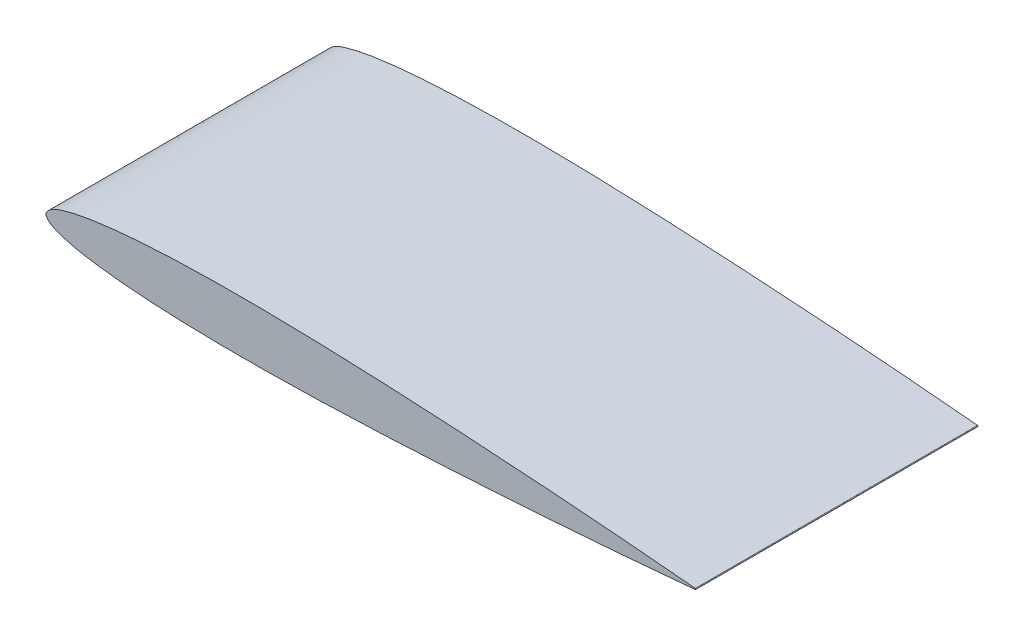
ISO-10303-21;
HEADER;
FILE_DESCRIPTION(('STEP AP214'),'2;1');
FILE_NAME('part.step','',(''),(''),'','','');
FILE_SCHEMA(('AUTOMOTIVE_DESIGN { 1 0 10303 214 1 1 1 1 }'));
ENDSEC;
DATA;
#1=APPLICATION_CONTEXT('core data for automotive mechanical design processes');
#2=APPLICATION_PROTOCOL_DEFINITION('international standard','automotive_design',2000,#1);
#3=PRODUCT_CONTEXT('',#1,'mechanical');
#4=PRODUCT('Part','Part','',(#3));
#5=PRODUCT_RELATED_PRODUCT_CATEGORY('part','',(#4));
#6=PRODUCT_DEFINITION_FORMATION('','',#4);
#7=PRODUCT_DEFINITION_CONTEXT('part definition',#1,'design');
#8=PRODUCT_DEFINITION('design','',#6,#7);
#9=PRODUCT_DEFINITION_SHAPE('','',#8);
#10=(LENGTH_UNIT() NAMED_UNIT(*) SI_UNIT(.MILLI.,.METRE.));
#11=(NAMED_UNIT(*) PLANE_ANGLE_UNIT() SI_UNIT($,.RADIAN.));
#12=(NAMED_UNIT(*) SI_UNIT($,.STERADIAN.) SOLID_ANGLE_UNIT());
#13=UNCERTAINTY_MEASURE_WITH_UNIT(LENGTH_MEASURE(1.E-05),#10,'distance_accuracy_value','');
#14=(GEOMETRIC_REPRESENTATION_CONTEXT(3) GLOBAL_UNCERTAINTY_ASSIGNED_CONTEXT((#13)) GLOBAL_UNIT_ASSIGNED_CONTEXT((#10,
#11,#12)) REPRESENTATION_CONTEXT('',''));
#15=CARTESIAN_POINT('',(0.,0.,0.));
#16=DIRECTION('',(0.,0.,1.));
#17=DIRECTION('',(1.,0.,0.));
#18=AXIS2_PLACEMENT_3D('',#15,#16,#17);
#19=CARTESIAN_POINT('',(115.,0.0966,50.));
#20=CARTESIAN_POINT('',(113.083512137173,0.272258452063669,50.));
#21=CARTESIAN_POINT('',(109.251373934239,0.623498591841248,50.));
#22=CARTESIAN_POINT('',(101.585893564366,1.27753382718011,50.));
#23=CARTESIAN_POINT('',(92.0037873596529,2.02815264449112,50.));
#24=CARTESIAN_POINT('',(80.5034487734738,2.82654094642564,50.));
#25=CARTESIAN_POINT('',(69.0035703192166,3.52100988200203,50.));
#26=CARTESIAN_POINT('',(57.5034598906153,4.08496009345538,50.));
#27=CARTESIAN_POINT('',(46.0029883413461,4.48838846778457,50.));
#28=CARTESIAN_POINT('',(36.4170057087206,4.62904917325832,50.));
#29=CARTESIAN_POINT('',(28.7490277903759,4.57347385950604,50.));
#30=CARTESIAN_POINT('',(22.997441924801,4.4217228580537,50.));
#31=CARTESIAN_POINT('',(17.2423676011774,4.13136000241049,50.));
#32=CARTESIAN_POINT('',(12.451261674613,3.72329931575348,50.));
#33=CARTESIAN_POINT('',(8.6124125462031,3.23612457176858,50.));
#34=CARTESIAN_POINT('',(5.74263384764909,2.76422401818186,50.));
#35=CARTESIAN_POINT('',(3.27707029080865,2.14811431843386,50.));
#36=CARTESIAN_POINT('',(1.34022552815491,1.51913533960532,50.));
#37=CARTESIAN_POINT('',(-0.764305851746083,0.,50.));
#38=CARTESIAN_POINT('',(1.3402255281549,-1.51913533960531,50.));
#39=CARTESIAN_POINT('',(3.27707029080866,-2.14811431843387,50.));
#40=CARTESIAN_POINT('',(5.74263384764909,-2.76422401818186,50.));
#41=CARTESIAN_POINT('',(8.61241254620308,-3.23612457176858,50.));
#42=CARTESIAN_POINT('',(12.451261674613,-3.72329931575348,50.));
#43=CARTESIAN_POINT('',(17.2423676011774,-4.13136000241049,50.));
#44=CARTESIAN_POINT('',(22.997441924801,-4.4217228580537,50.));
#45=CARTESIAN_POINT('',(28.7490277903759,-4.57347385950604,50.));
#46=CARTESIAN_POINT('',(36.4170057087206,-4.62904917325832,50.));
#47=CARTESIAN_POINT('',(46.0029883413461,-4.48838846778457,50.));
#48=CARTESIAN_POINT('',(57.5034598906153,-4.08496009345538,50.));
#49=CARTESIAN_POINT('',(69.0035703192166,-3.52100988200203,50.));
#50=CARTESIAN_POINT('',(80.5034487734738,-2.82654094642564,50.));
#51=CARTESIAN_POINT('',(92.0037873596529,-2.02815264449112,50.));
#52=CARTESIAN_POINT('',(101.585893564366,-1.27753382718011,50.));
#53=CARTESIAN_POINT('',(109.251373934239,-0.623498591841247,50.));
#54=CARTESIAN_POINT('',(113.083512137173,-0.272258452063669,50.));
#55=CARTESIAN_POINT('',(115.,-0.0966,50.));
#56=B_SPLINE_CURVE_WITH_KNOTS('',3,(#19,#20,#21,#22,#23,#24,#25,#26,#27,#28,#29,#30,#31,#32,#33,
#34,#35,#36,#37,#38,#39,#40,#41,#42,#43,#44,#45,#46,#47,#48,#49,#50,#51,#52,#53,#54,#55),
.UNSPECIFIED.,.F.,.F.,(4,1,1,1,1,1,1,1,1,1,1,1,1,1,1,1,1,1,1,1,1,1,1,1,1,1,1,1,1,1,1,1,1,1,4),
(0.,0.0248762929189861,0.0497417146704998,0.0994434021110951,0.149112224036195,
0.198750974066913,0.248359097492202,0.297937369716024,0.347491327096237,0.37226694027957,
0.39705092368842,0.421859474838904,0.446731345826762,0.459220451479859,0.471790601601357,
0.484560454432956,0.491195112481227,0.5,0.508804887518773,0.515439545567044,0.528209398398643,
0.540779548520142,0.553268654173238,0.578140525161096,0.60294907631158,0.62773305972043,
0.652508672903763,0.702062630283976,0.751640902507798,0.801249025933087,0.850887775963805,
0.900556597888905,0.9502582853295,0.975123707081014,1.),.UNSPECIFIED.);
#57=DIRECTION('',(0.,0.,-1.));
#58=VECTOR('',#57,1.);
#59=SURFACE_OF_LINEAR_EXTRUSION('',#56,#58);
#60=CARTESIAN_POINT('',(115.,0.0966,0.));
#61=CARTESIAN_POINT('',(113.083512137173,0.272258452063669,0.));
#62=CARTESIAN_POINT('',(109.251373934239,0.623498591841248,0.));
#63=CARTESIAN_POINT('',(101.585893564366,1.27753382718011,0.));
#64=CARTESIAN_POINT('',(92.0037873596529,2.02815264449112,0.));
#65=CARTESIAN_POINT('',(80.5034487734738,2.82654094642564,0.));
#66=CARTESIAN_POINT('',(69.0035703192166,3.52100988200203,0.));
#67=CARTESIAN_POINT('',(57.5034598906153,4.08496009345538,0.));
#68=CARTESIAN_POINT('',(46.0029883413461,4.48838846778457,0.));
#69=CARTESIAN_POINT('',(36.4170057087206,4.62904917325832,0.));
#70=CARTESIAN_POINT('',(28.7490277903759,4.57347385950604,0.));
#71=CARTESIAN_POINT('',(22.997441924801,4.4217228580537,0.));
#72=CARTESIAN_POINT('',(17.2423676011774,4.13136000241049,0.));
#73=CARTESIAN_POINT('',(12.451261674613,3.72329931575348,0.));
#74=CARTESIAN_POINT('',(8.6124125462031,3.23612457176858,0.));
#75=CARTESIAN_POINT('',(5.74263384764909,2.76422401818186,0.));
#76=CARTESIAN_POINT('',(3.27707029080865,2.14811431843386,0.));
#77=CARTESIAN_POINT('',(1.34022552815491,1.51913533960532,0.));
#78=CARTESIAN_POINT('',(-0.764305851746083,0.,0.));
#79=CARTESIAN_POINT('',(1.3402255281549,-1.51913533960531,0.));
#80=CARTESIAN_POINT('',(3.27707029080866,-2.14811431843387,0.));
#81=CARTESIAN_POINT('',(5.74263384764909,-2.76422401818186,0.));
#82=CARTESIAN_POINT('',(8.61241254620308,-3.23612457176858,0.));
#83=CARTESIAN_POINT('',(12.451261674613,-3.72329931575348,0.));
#84=CARTESIAN_POINT('',(17.2423676011774,-4.13136000241049,0.));
#85=CARTESIAN_POINT('',(22.997441924801,-4.4217228580537,0.));
#86=CARTESIAN_POINT('',(28.7490277903759,-4.57347385950604,0.));
#87=CARTESIAN_POINT('',(36.4170057087206,-4.62904917325832,0.));
#88=CARTESIAN_POINT('',(46.0029883413461,-4.48838846778457,0.));
#89=CARTESIAN_POINT('',(57.5034598906153,-4.08496009345538,0.));
#90=CARTESIAN_POINT('',(69.0035703192166,-3.52100988200203,0.));
#91=CARTESIAN_POINT('',(80.5034487734738,-2.82654094642564,0.));
#92=CARTESIAN_POINT('',(92.0037873596529,-2.02815264449112,0.));
#93=CARTESIAN_POINT('',(101.585893564366,-1.27753382718011,0.));
#94=CARTESIAN_POINT('',(109.251373934239,-0.623498591841247,0.));
#95=CARTESIAN_POINT('',(113.083512137173,-0.272258452063669,0.));
#96=CARTESIAN_POINT('',(115.,-0.0966,0.));
#97=B_SPLINE_CURVE_WITH_KNOTS('',3,(#60,#61,#62,#63,#64,#65,#66,#67,#68,#69,#70,#71,#72,#73,#74,
#75,#76,#77,#78,#79,#80,#81,#82,#83,#84,#85,#86,#87,#88,#89,#90,#91,#92,#93,#94,#95,#96),
.UNSPECIFIED.,.F.,.F.,(4,1,1,1,1,1,1,1,1,1,1,1,1,1,1,1,1,1,1,1,1,1,1,1,1,1,1,1,1,1,1,1,1,1,4),
(0.,0.0248762929189861,0.0497417146704998,0.0994434021110951,0.149112224036195,
0.198750974066913,0.248359097492202,0.297937369716024,0.347491327096237,0.37226694027957,
0.39705092368842,0.421859474838904,0.446731345826762,0.459220451479859,0.471790601601357,
0.484560454432956,0.491195112481227,0.5,0.508804887518773,0.515439545567044,0.528209398398643,
0.540779548520142,0.553268654173238,0.578140525161096,0.60294907631158,0.62773305972043,
0.652508672903763,0.702062630283976,0.751640902507798,0.801249025933087,0.850887775963805,
0.900556597888905,0.9502582853295,0.975123707081014,1.),.UNSPECIFIED.);
#98=CARTESIAN_POINT('',(115.,0.0966,0.));
#99=VERTEX_POINT('',#98);
#100=CARTESIAN_POINT('',(115.,-0.0966000000000001,0.));
#101=VERTEX_POINT('',#100);
#102=EDGE_CURVE('E65',#99,#101,#97,.T.);
#103=ORIENTED_EDGE('',*,*,#102,.T.);
#104=DIRECTION('',(0.,0.,-1.));
#105=VECTOR('',#104,1.);
#106=CARTESIAN_POINT('',(115.,-0.0966000000000001,50.));
#107=LINE('',#106,#105);
#108=CARTESIAN_POINT('',(115.,-0.0966000000000001,50.));
#109=VERTEX_POINT('',#108);
#110=EDGE_CURVE('E11',#109,#101,#107,.T.);
#111=ORIENTED_EDGE('',*,*,#110,.F.);
#112=CARTESIAN_POINT('',(115.,0.0966,50.));
#113=VERTEX_POINT('',#112);
#114=EDGE_CURVE('E64',#113,#109,#56,.T.);
#115=ORIENTED_EDGE('',*,*,#114,.F.);
#116=DIRECTION('',(0.,0.,-1.));
#117=VECTOR('',#116,1.);
#118=CARTESIAN_POINT('',(115.,0.0966,50.));
#119=LINE('',#118,#117);
#120=EDGE_CURVE('E42',#113,#99,#119,.T.);
#121=ORIENTED_EDGE('',*,*,#120,.T.);
#122=EDGE_LOOP('',(#103,#111,#115,#121));
#123=FACE_BOUND('',#122,.T.);
#124=ADVANCED_FACE('F33',(#123),#59,.F.);
#125=CARTESIAN_POINT('',(114.991145988034,0.,50.));
#126=DIRECTION('',(0.,0.,-1.));
#127=DIRECTION('',(-1.,0.,0.));
#128=AXIS2_PLACEMENT_3D('',#125,#126,#127);
#129=CYLINDRICAL_SURFACE('',#128,0.0970049149676787);
#130=CARTESIAN_POINT('',(114.991145988034,0.,0.));
#131=DIRECTION('',(0.,0.,1.));
#132=DIRECTION('',(-1.,0.,0.));
#133=AXIS2_PLACEMENT_3D('',#130,#131,#132);
#134=CIRCLE('',#133,0.0970049149676787);
#135=EDGE_CURVE('E57',#101,#99,#134,.T.);
#136=ORIENTED_EDGE('',*,*,#135,.T.);
#137=ORIENTED_EDGE('',*,*,#120,.F.);
#138=CARTESIAN_POINT('',(114.991145988034,0.,50.));
#139=DIRECTION('',(0.,0.,1.));
#140=DIRECTION('',(-1.,0.,0.));
#141=AXIS2_PLACEMENT_3D('',#138,#139,#140);
#142=CIRCLE('',#141,0.0970049149676787);
#143=EDGE_CURVE('E49',#109,#113,#142,.T.);
#144=ORIENTED_EDGE('',*,*,#143,.F.);
#145=ORIENTED_EDGE('',*,*,#110,.T.);
#146=EDGE_LOOP('',(#136,#137,#144,#145));
#147=FACE_BOUND('',#146,.T.);
#148=ADVANCED_FACE('F60',(#147),#129,.T.);
#149=CARTESIAN_POINT('',(0.,0.,50.));
#150=DIRECTION('',(0.,0.,-1.));
#151=DIRECTION('',(-1.,0.,0.));
#152=AXIS2_PLACEMENT_3D('',#149,#150,#151);
#153=PLANE('',#152);
#154=ORIENTED_EDGE('',*,*,#114,.T.);
#155=ORIENTED_EDGE('',*,*,#143,.T.);
#156=EDGE_LOOP('',(#154,#155));
#157=FACE_BOUND('',#156,.T.);
#158=ADVANCED_FACE('F82',(#157),#153,.F.);
#159=CARTESIAN_POINT('',(0.,0.,0.));
#160=DIRECTION('',(0.,0.,-1.));
#161=DIRECTION('',(-1.,0.,0.));
#162=AXIS2_PLACEMENT_3D('',#159,#160,#161);
#163=PLANE('',#162);
#164=ORIENTED_EDGE('',*,*,#102,.F.);
#165=ORIENTED_EDGE('',*,*,#135,.F.);
#166=EDGE_LOOP('',(#164,#165));
#167=FACE_BOUND('',#166,.T.);
#168=ADVANCED_FACE('F68',(#167),#163,.T.);
#169=CLOSED_SHELL('',(#124,#148,#158,#168));
#170=MANIFOLD_SOLID_BREP('B2',#169);
#171=ADVANCED_BREP_SHAPE_REPRESENTATION('',(#18,#170),#14);
#172=SHAPE_DEFINITION_REPRESENTATION(#9,#171);
ENDSEC;
END-ISO-10303-21;
